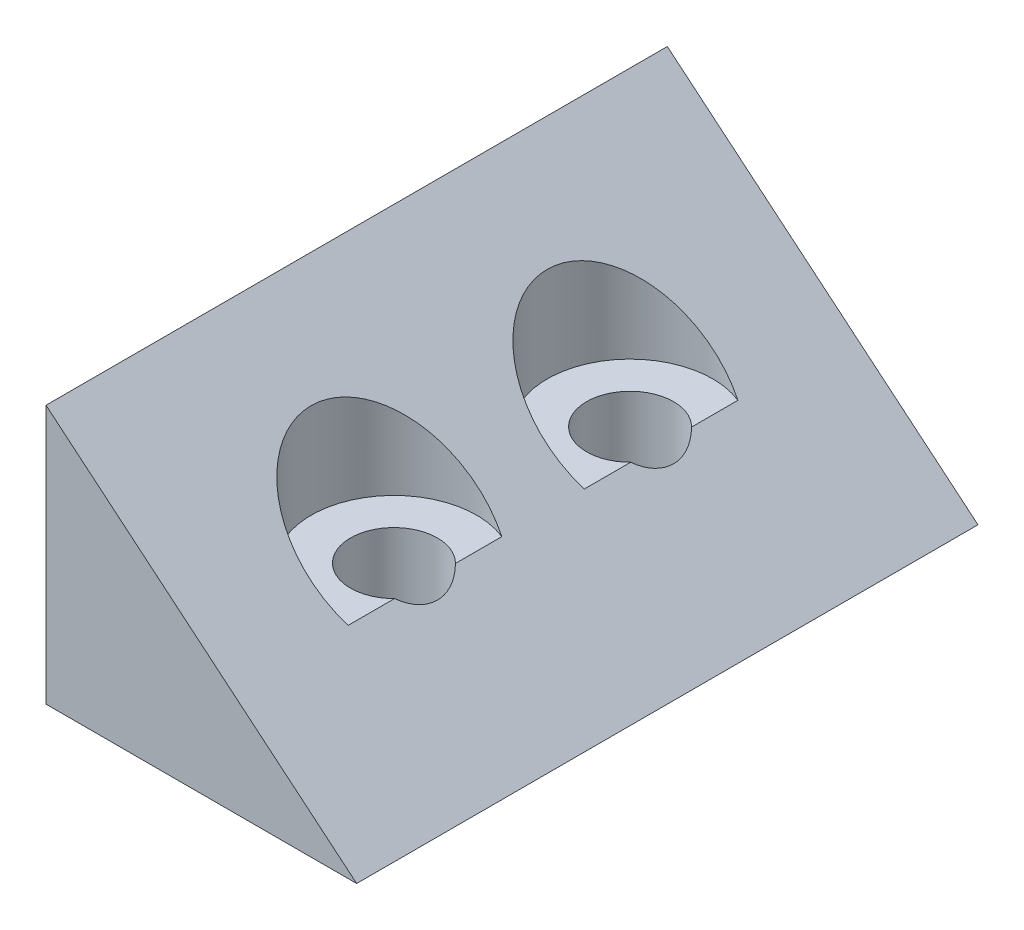
ISO-10303-21;
HEADER;
FILE_DESCRIPTION(('STEP AP214'),'2;1');
FILE_NAME('part.step','',(''),(''),'','','');
FILE_SCHEMA(('AUTOMOTIVE_DESIGN { 1 0 10303 214 1 1 1 1 }'));
ENDSEC;
DATA;
#1=APPLICATION_CONTEXT('core data for automotive mechanical design processes');
#2=APPLICATION_PROTOCOL_DEFINITION('international standard','automotive_design',2000,#1);
#3=PRODUCT_CONTEXT('',#1,'mechanical');
#4=PRODUCT('Part','Part','',(#3));
#5=PRODUCT_RELATED_PRODUCT_CATEGORY('part','',(#4));
#6=PRODUCT_DEFINITION_FORMATION('','',#4);
#7=PRODUCT_DEFINITION_CONTEXT('part definition',#1,'design');
#8=PRODUCT_DEFINITION('design','',#6,#7);
#9=PRODUCT_DEFINITION_SHAPE('','',#8);
#10=(LENGTH_UNIT() NAMED_UNIT(*) SI_UNIT(.MILLI.,.METRE.));
#11=(NAMED_UNIT(*) PLANE_ANGLE_UNIT() SI_UNIT($,.RADIAN.));
#12=(NAMED_UNIT(*) SI_UNIT($,.STERADIAN.) SOLID_ANGLE_UNIT());
#13=UNCERTAINTY_MEASURE_WITH_UNIT(LENGTH_MEASURE(1.E-05),#10,'distance_accuracy_value','');
#14=(GEOMETRIC_REPRESENTATION_CONTEXT(3) GLOBAL_UNCERTAINTY_ASSIGNED_CONTEXT((#13)) GLOBAL_UNIT_ASSIGNED_CONTEXT((#10,
#11,#12)) REPRESENTATION_CONTEXT('',''));
#15=CARTESIAN_POINT('',(0.,0.,0.));
#16=DIRECTION('',(0.,0.,1.));
#17=DIRECTION('',(1.,0.,0.));
#18=AXIS2_PLACEMENT_3D('',#15,#16,#17);
#19=CARTESIAN_POINT('',(0.,12.5,30.));
#20=DIRECTION('',(1.,0.,0.));
#21=DIRECTION('',(0.,1.,0.));
#22=AXIS2_PLACEMENT_3D('',#19,#20,#21);
#23=PLANE('',#22);
#24=DIRECTION('',(0.,-1.,0.));
#25=VECTOR('',#24,1.);
#26=CARTESIAN_POINT('',(0.,12.5,0.));
#27=LINE('',#26,#25);
#28=CARTESIAN_POINT('',(0.,12.5,0.));
#29=VERTEX_POINT('',#28);
#30=CARTESIAN_POINT('',(0.,0.,0.));
#31=VERTEX_POINT('',#30);
#32=EDGE_CURVE('E118',#29,#31,#27,.T.);
#33=ORIENTED_EDGE('',*,*,#32,.T.);
#34=DIRECTION('',(0.,0.,-1.));
#35=VECTOR('',#34,1.);
#36=CARTESIAN_POINT('',(0.,0.,30.));
#37=LINE('',#36,#35);
#38=CARTESIAN_POINT('',(0.,0.,30.));
#39=VERTEX_POINT('',#38);
#40=EDGE_CURVE('E115',#39,#31,#37,.T.);
#41=ORIENTED_EDGE('',*,*,#40,.F.);
#42=DIRECTION('',(0.,-1.,0.));
#43=VECTOR('',#42,1.);
#44=CARTESIAN_POINT('',(0.,12.5,30.));
#45=LINE('',#44,#43);
#46=CARTESIAN_POINT('',(0.,12.5,30.));
#47=VERTEX_POINT('',#46);
#48=EDGE_CURVE('E134',#47,#39,#45,.T.);
#49=ORIENTED_EDGE('',*,*,#48,.F.);
#50=DIRECTION('',(0.,0.,-1.));
#51=VECTOR('',#50,1.);
#52=CARTESIAN_POINT('',(0.,12.5,30.));
#53=LINE('',#52,#51);
#54=EDGE_CURVE('E128',#47,#29,#53,.T.);
#55=ORIENTED_EDGE('',*,*,#54,.T.);
#56=EDGE_LOOP('',(#33,#41,#49,#55));
#57=FACE_BOUND('',#56,.T.);
#58=ADVANCED_FACE('F37',(#57),#23,.F.);
#59=CARTESIAN_POINT('',(0.,0.,30.));
#60=DIRECTION('',(0.,1.,0.));
#61=DIRECTION('',(0.,0.,1.));
#62=AXIS2_PLACEMENT_3D('',#59,#60,#61);
#63=PLANE('',#62);
#64=CARTESIAN_POINT('',(7.5,0.,9.3));
#65=DIRECTION('',(0.,-1.,0.));
#66=DIRECTION('',(0.,0.,-1.));
#67=AXIS2_PLACEMENT_3D('',#64,#65,#66);
#68=CIRCLE('',#67,2.1);
#69=CARTESIAN_POINT('',(7.5,0.,7.2));
#70=VERTEX_POINT('',#69);
#71=EDGE_CURVE('E122',#70,#70,#68,.T.);
#72=ORIENTED_EDGE('',*,*,#71,.F.);
#73=EDGE_LOOP('',(#72));
#74=FACE_BOUND('',#73,.T.);
#75=CARTESIAN_POINT('',(7.5,0.,20.7));
#76=DIRECTION('',(0.,-1.,0.));
#77=DIRECTION('',(0.,0.,-1.));
#78=AXIS2_PLACEMENT_3D('',#75,#76,#77);
#79=CIRCLE('',#78,2.1);
#80=CARTESIAN_POINT('',(7.5,0.,18.6));
#81=VERTEX_POINT('',#80);
#82=EDGE_CURVE('E144',#81,#81,#79,.T.);
#83=ORIENTED_EDGE('',*,*,#82,.F.);
#84=EDGE_LOOP('',(#83));
#85=FACE_BOUND('',#84,.T.);
#86=DIRECTION('',(1.,0.,0.));
#87=VECTOR('',#86,1.);
#88=CARTESIAN_POINT('',(0.,0.,0.));
#89=LINE('',#88,#87);
#90=CARTESIAN_POINT('',(15.,0.,0.));
#91=VERTEX_POINT('',#90);
#92=EDGE_CURVE('E135',#31,#91,#89,.T.);
#93=ORIENTED_EDGE('',*,*,#92,.T.);
#94=DIRECTION('',(0.,0.,-1.));
#95=VECTOR('',#94,1.);
#96=CARTESIAN_POINT('',(15.,0.,30.));
#97=LINE('',#96,#95);
#98=CARTESIAN_POINT('',(15.,0.,30.));
#99=VERTEX_POINT('',#98);
#100=EDGE_CURVE('E125',#99,#91,#97,.T.);
#101=ORIENTED_EDGE('',*,*,#100,.F.);
#102=DIRECTION('',(1.,0.,0.));
#103=VECTOR('',#102,1.);
#104=CARTESIAN_POINT('',(0.,0.,30.));
#105=LINE('',#104,#103);
#106=EDGE_CURVE('E140',#39,#99,#105,.T.);
#107=ORIENTED_EDGE('',*,*,#106,.F.);
#108=ORIENTED_EDGE('',*,*,#40,.T.);
#109=EDGE_LOOP('',(#93,#101,#107,#108));
#110=FACE_BOUND('',#109,.T.);
#111=ADVANCED_FACE('F167',(#74,#85,#110),#63,.F.);
#112=CARTESIAN_POINT('',(15.,0.,30.));
#113=DIRECTION('',(-0.64018439966448,-0.768221279597376,0.));
#114=DIRECTION('',(0.768221279597376,-0.64018439966448,0.));
#115=AXIS2_PLACEMENT_3D('',#112,#113,#114);
#116=PLANE('',#115);
#117=CARTESIAN_POINT('',(7.5,6.25,9.3));
#118=DIRECTION('',(-0.64018439966448,-0.768221279597376,0.));
#119=DIRECTION('',(0.768221279597376,-0.64018439966448,0.));
#120=AXIS2_PLACEMENT_3D('',#117,#118,#119);
#121=ELLIPSE('',#120,5.20683311727111,4.);
#122=CARTESIAN_POINT('',(9.,5.,13.0080992435478));
#123=VERTEX_POINT('',#122);
#124=CARTESIAN_POINT('',(9.,5.,5.59190075645216));
#125=VERTEX_POINT('',#124);
#126=EDGE_CURVE('E44',#123,#125,#121,.T.);
#127=ORIENTED_EDGE('',*,*,#126,.T.);
#128=DIRECTION('',(0.,0.,1.));
#129=VECTOR('',#128,1.);
#130=CARTESIAN_POINT('',(9.,5.,30.));
#131=LINE('',#130,#129);
#132=CARTESIAN_POINT('',(9.,5.,7.83030615433008));
#133=VERTEX_POINT('',#132);
#134=EDGE_CURVE('E95',#125,#133,#131,.T.);
#135=ORIENTED_EDGE('',*,*,#134,.T.);
#136=CARTESIAN_POINT('',(7.5,6.25,9.3));
#137=DIRECTION('',(-0.64018439966448,-0.768221279597376,0.));
#138=DIRECTION('',(0.768221279597376,-0.64018439966448,0.));
#139=AXIS2_PLACEMENT_3D('',#136,#137,#138);
#140=ELLIPSE('',#139,2.73358738656733,2.1);
#141=CARTESIAN_POINT('',(9.,5.,10.7696938456699));
#142=VERTEX_POINT('',#141);
#143=EDGE_CURVE('E116',#133,#142,#140,.T.);
#144=ORIENTED_EDGE('',*,*,#143,.T.);
#145=EDGE_CURVE('E59',#142,#123,#131,.T.);
#146=ORIENTED_EDGE('',*,*,#145,.T.);
#147=EDGE_LOOP('',(#127,#135,#144,#146));
#148=FACE_BOUND('',#147,.T.);
#149=CARTESIAN_POINT('',(7.5,6.25,20.7));
#150=DIRECTION('',(-0.64018439966448,-0.768221279597376,0.));
#151=DIRECTION('',(0.768221279597376,-0.64018439966448,0.));
#152=AXIS2_PLACEMENT_3D('',#149,#150,#151);
#153=ELLIPSE('',#152,5.20683311727111,4.);
#154=CARTESIAN_POINT('',(9.,5.,24.4080992435478));
#155=VERTEX_POINT('',#154);
#156=CARTESIAN_POINT('',(9.,5.,16.9919007564522));
#157=VERTEX_POINT('',#156);
#158=EDGE_CURVE('E11',#155,#157,#153,.T.);
#159=ORIENTED_EDGE('',*,*,#158,.T.);
#160=DIRECTION('',(0.,0.,1.));
#161=VECTOR('',#160,1.);
#162=CARTESIAN_POINT('',(9.,5.,30.));
#163=LINE('',#162,#161);
#164=CARTESIAN_POINT('',(9.,5.,19.2303061543301));
#165=VERTEX_POINT('',#164);
#166=EDGE_CURVE('E147',#157,#165,#163,.T.);
#167=ORIENTED_EDGE('',*,*,#166,.T.);
#168=CARTESIAN_POINT('',(7.5,6.25,20.7));
#169=DIRECTION('',(-0.64018439966448,-0.768221279597376,0.));
#170=DIRECTION('',(0.768221279597376,-0.64018439966448,0.));
#171=AXIS2_PLACEMENT_3D('',#168,#169,#170);
#172=ELLIPSE('',#171,2.73358738656733,2.1);
#173=CARTESIAN_POINT('',(9.,5.,22.1696938456699));
#174=VERTEX_POINT('',#173);
#175=EDGE_CURVE('E119',#165,#174,#172,.T.);
#176=ORIENTED_EDGE('',*,*,#175,.T.);
#177=EDGE_CURVE('E51',#174,#155,#163,.T.);
#178=ORIENTED_EDGE('',*,*,#177,.T.);
#179=EDGE_LOOP('',(#159,#167,#176,#178));
#180=FACE_BOUND('',#179,.T.);
#181=DIRECTION('',(-0.768221279597376,0.64018439966448,0.));
#182=VECTOR('',#181,1.);
#183=CARTESIAN_POINT('',(15.,0.,0.));
#184=LINE('',#183,#182);
#185=EDGE_CURVE('E132',#91,#29,#184,.T.);
#186=ORIENTED_EDGE('',*,*,#185,.T.);
#187=ORIENTED_EDGE('',*,*,#54,.F.);
#188=DIRECTION('',(-0.768221279597376,0.64018439966448,0.));
#189=VECTOR('',#188,1.);
#190=CARTESIAN_POINT('',(15.,0.,30.));
#191=LINE('',#190,#189);
#192=EDGE_CURVE('E131',#99,#47,#191,.T.);
#193=ORIENTED_EDGE('',*,*,#192,.F.);
#194=ORIENTED_EDGE('',*,*,#100,.T.);
#195=EDGE_LOOP('',(#186,#187,#193,#194));
#196=FACE_BOUND('',#195,.T.);
#197=ADVANCED_FACE('F109',(#148,#180,#196),#116,.F.);
#198=CARTESIAN_POINT('',(0.,0.,30.));
#199=DIRECTION('',(0.,0.,1.));
#200=DIRECTION('',(1.,0.,0.));
#201=AXIS2_PLACEMENT_3D('',#198,#199,#200);
#202=PLANE('',#201);
#203=ORIENTED_EDGE('',*,*,#48,.T.);
#204=ORIENTED_EDGE('',*,*,#106,.T.);
#205=ORIENTED_EDGE('',*,*,#192,.T.);
#206=EDGE_LOOP('',(#203,#204,#205));
#207=FACE_BOUND('',#206,.T.);
#208=ADVANCED_FACE('F184',(#207),#202,.T.);
#209=CARTESIAN_POINT('',(0.,0.,0.));
#210=DIRECTION('',(0.,0.,1.));
#211=DIRECTION('',(1.,0.,0.));
#212=AXIS2_PLACEMENT_3D('',#209,#210,#211);
#213=PLANE('',#212);
#214=ORIENTED_EDGE('',*,*,#32,.F.);
#215=ORIENTED_EDGE('',*,*,#185,.F.);
#216=ORIENTED_EDGE('',*,*,#92,.F.);
#217=EDGE_LOOP('',(#214,#215,#216));
#218=FACE_BOUND('',#217,.T.);
#219=ADVANCED_FACE('F179',(#218),#213,.F.);
#220=CARTESIAN_POINT('',(7.5,30.,20.7));
#221=DIRECTION('',(0.,-1.,0.));
#222=DIRECTION('',(0.,0.,-1.));
#223=AXIS2_PLACEMENT_3D('',#220,#221,#222);
#224=CYLINDRICAL_SURFACE('',#223,2.1);
#225=ORIENTED_EDGE('',*,*,#82,.T.);
#226=EDGE_LOOP('',(#225));
#227=FACE_BOUND('',#226,.T.);
#228=ORIENTED_EDGE('',*,*,#175,.F.);
#229=CARTESIAN_POINT('',(7.5,5.,20.7));
#230=DIRECTION('',(0.,-1.,0.));
#231=DIRECTION('',(0.,0.,-1.));
#232=AXIS2_PLACEMENT_3D('',#229,#230,#231);
#233=CIRCLE('',#232,2.1);
#234=EDGE_CURVE('E111',#165,#174,#233,.F.);
#235=ORIENTED_EDGE('',*,*,#234,.T.);
#236=EDGE_LOOP('',(#228,#235));
#237=FACE_BOUND('',#236,.T.);
#238=ADVANCED_FACE('F158',(#227,#237),#224,.F.);
#239=CARTESIAN_POINT('',(7.5,30.,9.3));
#240=DIRECTION('',(0.,-1.,0.));
#241=DIRECTION('',(0.,0.,-1.));
#242=AXIS2_PLACEMENT_3D('',#239,#240,#241);
#243=CYLINDRICAL_SURFACE('',#242,2.1);
#244=ORIENTED_EDGE('',*,*,#71,.T.);
#245=EDGE_LOOP('',(#244));
#246=FACE_BOUND('',#245,.T.);
#247=ORIENTED_EDGE('',*,*,#143,.F.);
#248=CARTESIAN_POINT('',(7.5,5.,9.3));
#249=DIRECTION('',(0.,-1.,0.));
#250=DIRECTION('',(0.,0.,-1.));
#251=AXIS2_PLACEMENT_3D('',#248,#249,#250);
#252=CIRCLE('',#251,2.1);
#253=EDGE_CURVE('E99',#133,#142,#252,.F.);
#254=ORIENTED_EDGE('',*,*,#253,.T.);
#255=EDGE_LOOP('',(#247,#254));
#256=FACE_BOUND('',#255,.T.);
#257=ADVANCED_FACE('F196',(#246,#256),#243,.F.);
#258=CARTESIAN_POINT('',(7.5,12.5,9.3));
#259=DIRECTION('',(0.,-1.,0.));
#260=DIRECTION('',(0.,0.,-1.));
#261=AXIS2_PLACEMENT_3D('',#258,#259,#260);
#262=CYLINDRICAL_SURFACE('',#261,4.);
#263=CARTESIAN_POINT('',(7.5,5.,9.3));
#264=DIRECTION('',(0.,-1.,0.));
#265=DIRECTION('',(0.,0.,-1.));
#266=AXIS2_PLACEMENT_3D('',#263,#264,#265);
#267=CIRCLE('',#266,4.);
#268=EDGE_CURVE('E98',#123,#125,#267,.T.);
#269=ORIENTED_EDGE('',*,*,#268,.T.);
#270=ORIENTED_EDGE('',*,*,#126,.F.);
#271=EDGE_LOOP('',(#269,#270));
#272=FACE_BOUND('',#271,.T.);
#273=ADVANCED_FACE('F106',(#272),#262,.F.);
#274=CARTESIAN_POINT('',(7.5,5.,9.3));
#275=DIRECTION('',(0.,-1.,0.));
#276=DIRECTION('',(0.,0.,-1.));
#277=AXIS2_PLACEMENT_3D('',#274,#275,#276);
#278=PLANE('',#277);
#279=ORIENTED_EDGE('',*,*,#268,.F.);
#280=ORIENTED_EDGE('',*,*,#145,.F.);
#281=ORIENTED_EDGE('',*,*,#253,.F.);
#282=ORIENTED_EDGE('',*,*,#134,.F.);
#283=EDGE_LOOP('',(#279,#280,#281,#282));
#284=FACE_BOUND('',#283,.T.);
#285=ADVANCED_FACE('F97',(#284),#278,.F.);
#286=CARTESIAN_POINT('',(7.5,12.5,20.7));
#287=DIRECTION('',(0.,-1.,0.));
#288=DIRECTION('',(0.,0.,-1.));
#289=AXIS2_PLACEMENT_3D('',#286,#287,#288);
#290=CYLINDRICAL_SURFACE('',#289,4.);
#291=CARTESIAN_POINT('',(7.5,5.,20.7));
#292=DIRECTION('',(0.,-1.,0.));
#293=DIRECTION('',(0.,0.,-1.));
#294=AXIS2_PLACEMENT_3D('',#291,#292,#293);
#295=CIRCLE('',#294,4.);
#296=EDGE_CURVE('E107',#155,#157,#295,.T.);
#297=ORIENTED_EDGE('',*,*,#296,.T.);
#298=ORIENTED_EDGE('',*,*,#158,.F.);
#299=EDGE_LOOP('',(#297,#298));
#300=FACE_BOUND('',#299,.T.);
#301=ADVANCED_FACE('F153',(#300),#290,.F.);
#302=CARTESIAN_POINT('',(7.5,5.,20.7));
#303=DIRECTION('',(0.,-1.,0.));
#304=DIRECTION('',(0.,0.,-1.));
#305=AXIS2_PLACEMENT_3D('',#302,#303,#304);
#306=PLANE('',#305);
#307=ORIENTED_EDGE('',*,*,#296,.F.);
#308=ORIENTED_EDGE('',*,*,#177,.F.);
#309=ORIENTED_EDGE('',*,*,#234,.F.);
#310=ORIENTED_EDGE('',*,*,#166,.F.);
#311=EDGE_LOOP('',(#307,#308,#309,#310));
#312=FACE_BOUND('',#311,.T.);
#313=ADVANCED_FACE('F159',(#312),#306,.F.);
#314=CLOSED_SHELL('',(#58,#111,#197,#208,#219,#238,#257,#273,#285,#301,#313));
#315=MANIFOLD_SOLID_BREP('B2',#314);
#316=ADVANCED_BREP_SHAPE_REPRESENTATION('',(#18,#315),#14);
#317=SHAPE_DEFINITION_REPRESENTATION(#9,#316);
ENDSEC;
END-ISO-10303-21;
